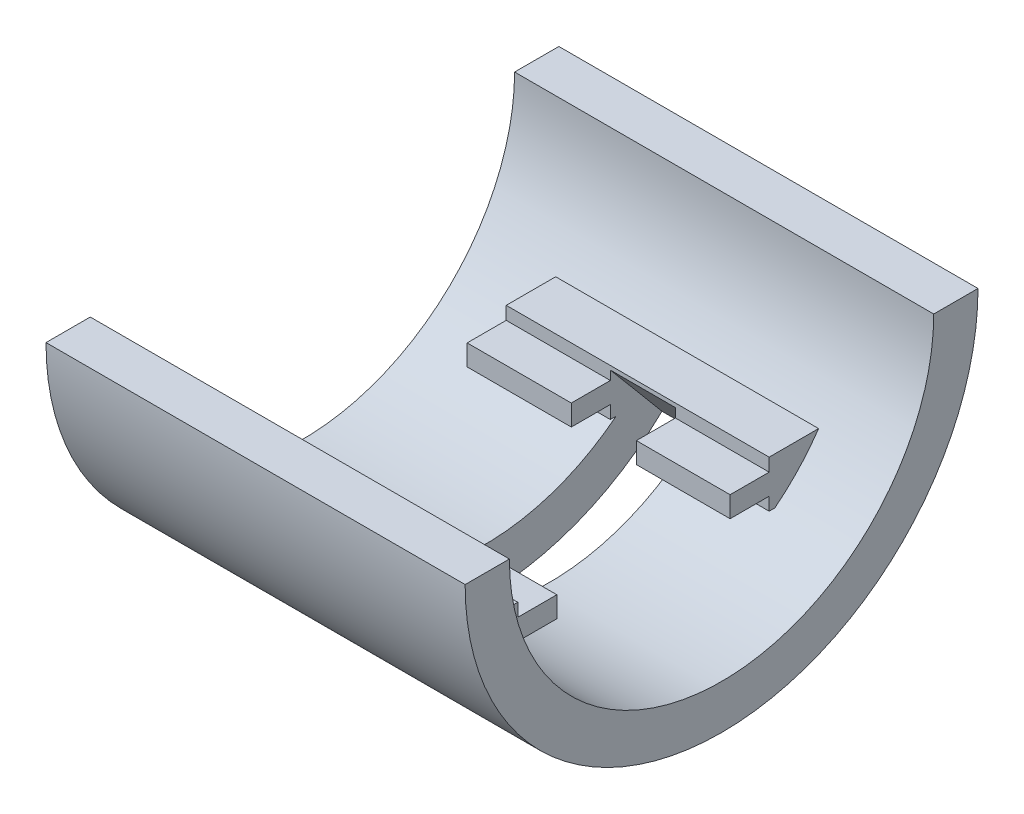
ISO-10303-21;
HEADER;
FILE_DESCRIPTION(('STEP AP214'),'2;1');
FILE_NAME('part.step','',(''),(''),'','','');
FILE_SCHEMA(('AUTOMOTIVE_DESIGN { 1 0 10303 214 1 1 1 1 }'));
ENDSEC;
DATA;
#1=APPLICATION_CONTEXT('core data for automotive mechanical design processes');
#2=APPLICATION_PROTOCOL_DEFINITION('international standard','automotive_design',2000,#1);
#3=PRODUCT_CONTEXT('',#1,'mechanical');
#4=PRODUCT('Part','Part','',(#3));
#5=PRODUCT_RELATED_PRODUCT_CATEGORY('part','',(#4));
#6=PRODUCT_DEFINITION_FORMATION('','',#4);
#7=PRODUCT_DEFINITION_CONTEXT('part definition',#1,'design');
#8=PRODUCT_DEFINITION('design','',#6,#7);
#9=PRODUCT_DEFINITION_SHAPE('','',#8);
#10=(LENGTH_UNIT() NAMED_UNIT(*) SI_UNIT(.MILLI.,.METRE.));
#11=(NAMED_UNIT(*) PLANE_ANGLE_UNIT() SI_UNIT($,.RADIAN.));
#12=(NAMED_UNIT(*) SI_UNIT($,.STERADIAN.) SOLID_ANGLE_UNIT());
#13=UNCERTAINTY_MEASURE_WITH_UNIT(LENGTH_MEASURE(1.E-05),#10,'distance_accuracy_value','');
#14=(GEOMETRIC_REPRESENTATION_CONTEXT(3) GLOBAL_UNCERTAINTY_ASSIGNED_CONTEXT((#13)) GLOBAL_UNIT_ASSIGNED_CONTEXT((#10,
#11,#12)) REPRESENTATION_CONTEXT('',''));
#15=CARTESIAN_POINT('',(0.,0.,0.));
#16=DIRECTION('',(0.,0.,1.));
#17=DIRECTION('',(1.,0.,0.));
#18=AXIS2_PLACEMENT_3D('',#15,#16,#17);
#19=CARTESIAN_POINT('',(0.,0.,0.));
#20=DIRECTION('',(0.,-1.,0.));
#21=DIRECTION('',(0.,0.,-1.));
#22=AXIS2_PLACEMENT_3D('',#19,#20,#21);
#23=PLANE('',#22);
#24=DIRECTION('',(-1.,0.,0.));
#25=VECTOR('',#24,1.);
#26=CARTESIAN_POINT('',(4.826,-1.74706743233033E-13,25.019));
#27=LINE('',#26,#25);
#28=CARTESIAN_POINT('',(0.,-1.74706743233033E-13,25.019));
#29=VERTEX_POINT('',#28);
#30=CARTESIAN_POINT('',(-40.894,-1.74706743233033E-13,25.019));
#31=VERTEX_POINT('',#30);
#32=EDGE_CURVE('E277',#29,#31,#27,.T.);
#33=ORIENTED_EDGE('',*,*,#32,.F.);
#34=DIRECTION('',(0.,0.,-1.));
#35=VECTOR('',#34,1.);
#36=CARTESIAN_POINT('',(0.,0.,0.));
#37=LINE('',#36,#35);
#38=CARTESIAN_POINT('',(0.,0.,20.701));
#39=VERTEX_POINT('',#38);
#40=EDGE_CURVE('E284',#29,#39,#37,.T.);
#41=ORIENTED_EDGE('',*,*,#40,.T.);
#42=DIRECTION('',(1.,0.,0.));
#43=VECTOR('',#42,1.);
#44=CARTESIAN_POINT('',(0.,-1.44554310390783E-13,20.701));
#45=LINE('',#44,#43);
#46=CARTESIAN_POINT('',(-40.894,-1.44554310390783E-13,20.701));
#47=VERTEX_POINT('',#46);
#48=EDGE_CURVE('E283',#47,#39,#45,.T.);
#49=ORIENTED_EDGE('',*,*,#48,.F.);
#50=DIRECTION('',(0.,0.,1.));
#51=VECTOR('',#50,1.);
#52=CARTESIAN_POINT('',(-40.894,0.,0.));
#53=LINE('',#52,#51);
#54=EDGE_CURVE('E272',#47,#31,#53,.T.);
#55=ORIENTED_EDGE('',*,*,#54,.T.);
#56=EDGE_LOOP('',(#33,#41,#49,#55));
#57=FACE_BOUND('',#56,.T.);
#58=ADVANCED_FACE('F37',(#57),#23,.F.);
#59=CARTESIAN_POINT('',(0.,0.,0.));
#60=DIRECTION('',(1.,0.,0.));
#61=DIRECTION('',(0.,0.,1.));
#62=AXIS2_PLACEMENT_3D('',#59,#60,#61);
#63=PLANE('',#62);
#64=CARTESIAN_POINT('',(0.,1.44554310390783E-13,-20.701));
#65=VERTEX_POINT('',#64);
#66=CARTESIAN_POINT('',(0.,1.74706743233033E-13,-25.019));
#67=VERTEX_POINT('',#66);
#68=EDGE_CURVE('E504',#65,#67,#37,.T.);
#69=ORIENTED_EDGE('',*,*,#68,.F.);
#70=CARTESIAN_POINT('',(0.,0.,0.));
#71=DIRECTION('',(-1.,0.,0.));
#72=DIRECTION('',(0.,0.,1.));
#73=AXIS2_PLACEMENT_3D('',#70,#71,#72);
#74=CIRCLE('',#73,20.701);
#75=EDGE_CURVE('E500',#65,#39,#74,.T.);
#76=ORIENTED_EDGE('',*,*,#75,.T.);
#77=ORIENTED_EDGE('',*,*,#40,.F.);
#78=CARTESIAN_POINT('',(0.,0.,0.));
#79=DIRECTION('',(-1.,0.,0.));
#80=DIRECTION('',(0.,0.,1.));
#81=AXIS2_PLACEMENT_3D('',#78,#79,#80);
#82=CIRCLE('',#81,25.019);
#83=EDGE_CURVE('E287',#67,#29,#82,.T.);
#84=ORIENTED_EDGE('',*,*,#83,.F.);
#85=EDGE_LOOP('',(#69,#76,#77,#84));
#86=FACE_BOUND('',#85,.T.);
#87=ADVANCED_FACE('F660',(#86),#63,.T.);
#88=CARTESIAN_POINT('',(-40.894,0.,0.));
#89=DIRECTION('',(-1.,0.,0.));
#90=DIRECTION('',(0.,0.,-1.));
#91=AXIS2_PLACEMENT_3D('',#88,#89,#90);
#92=PLANE('',#91);
#93=ORIENTED_EDGE('',*,*,#54,.F.);
#94=CARTESIAN_POINT('',(-40.894,0.,0.));
#95=DIRECTION('',(1.,0.,0.));
#96=DIRECTION('',(0.,0.,-1.));
#97=AXIS2_PLACEMENT_3D('',#94,#95,#96);
#98=CIRCLE('',#97,20.701);
#99=CARTESIAN_POINT('',(-40.894,1.44554310390783E-13,-20.701));
#100=VERTEX_POINT('',#99);
#101=EDGE_CURVE('E502',#47,#100,#98,.T.);
#102=ORIENTED_EDGE('',*,*,#101,.T.);
#103=CARTESIAN_POINT('',(-40.894,1.74706743233033E-13,-25.019));
#104=VERTEX_POINT('',#103);
#105=EDGE_CURVE('E275',#104,#100,#53,.T.);
#106=ORIENTED_EDGE('',*,*,#105,.F.);
#107=CARTESIAN_POINT('',(-40.894,0.,0.));
#108=DIRECTION('',(1.,0.,0.));
#109=DIRECTION('',(0.,0.,-1.));
#110=AXIS2_PLACEMENT_3D('',#107,#108,#109);
#111=CIRCLE('',#110,25.019);
#112=EDGE_CURVE('E269',#31,#104,#111,.T.);
#113=ORIENTED_EDGE('',*,*,#112,.F.);
#114=EDGE_LOOP('',(#93,#102,#106,#113));
#115=FACE_BOUND('',#114,.T.);
#116=ADVANCED_FACE('F39',(#115),#92,.T.);
#117=DIRECTION('',(-1.,0.,0.));
#118=VECTOR('',#117,1.);
#119=CARTESIAN_POINT('',(4.826,1.74706743233033E-13,-25.019));
#120=LINE('',#119,#118);
#121=EDGE_CURVE('E52',#67,#104,#120,.T.);
#122=ORIENTED_EDGE('',*,*,#121,.T.);
#123=ORIENTED_EDGE('',*,*,#105,.T.);
#124=DIRECTION('',(1.,0.,0.));
#125=VECTOR('',#124,1.);
#126=CARTESIAN_POINT('',(0.,1.44554310390783E-13,-20.701));
#127=LINE('',#126,#125);
#128=EDGE_CURVE('E506',#65,#100,#127,.F.);
#129=ORIENTED_EDGE('',*,*,#128,.F.);
#130=ORIENTED_EDGE('',*,*,#68,.T.);
#131=EDGE_LOOP('',(#122,#123,#129,#130));
#132=FACE_BOUND('',#131,.T.);
#133=ADVANCED_FACE('F662',(#132),#23,.F.);
#134=CARTESIAN_POINT('',(0.,0.594247114477798,-1.63268052860381));
#135=DIRECTION('',(0.,-0.642787609686541,0.766044443118977));
#136=DIRECTION('',(-1.,0.,0.));
#137=AXIS2_PLACEMENT_3D('',#134,#135,#136);
#138=PLANE('',#137);
#139=DIRECTION('',(0.,-0.766044443118977,-0.642787609686541));
#140=VECTOR('',#139,1.);
#141=CARTESIAN_POINT('',(-16.764,-21.1045473889342,-19.8401309934085));
#142=LINE('',#141,#140);
#143=CARTESIAN_POINT('',(-16.764,-12.073833542669,-12.2624623357398));
#144=VERTEX_POINT('',#143);
#145=CARTESIAN_POINT('',(-16.764,-18.0753465215828,-17.298329662852));
#146=VERTEX_POINT('',#145);
#147=EDGE_CURVE('E303',#144,#146,#142,.T.);
#148=ORIENTED_EDGE('',*,*,#147,.F.);
#149=DIRECTION('',(1.,0.,0.));
#150=VECTOR('',#149,1.);
#151=CARTESIAN_POINT('',(-33.274,-12.073833542669,-12.2624623357398));
#152=LINE('',#151,#150);
#153=CARTESIAN_POINT('',(-23.114,-12.073833542669,-12.2624623357398));
#154=VERTEX_POINT('',#153);
#155=EDGE_CURVE('E382',#154,#144,#152,.T.);
#156=ORIENTED_EDGE('',*,*,#155,.F.);
#157=DIRECTION('',(0.,0.766044443118977,0.642787609686541));
#158=VECTOR('',#157,1.);
#159=CARTESIAN_POINT('',(-23.114,-21.1045473889342,-19.8401309934085));
#160=LINE('',#159,#158);
#161=CARTESIAN_POINT('',(-23.114,-18.0753465215828,-17.298329662852));
#162=VERTEX_POINT('',#161);
#163=EDGE_CURVE('E300',#162,#154,#160,.T.);
#164=ORIENTED_EDGE('',*,*,#163,.F.);
#165=DIRECTION('',(-1.,0.,0.));
#166=VECTOR('',#165,1.);
#167=CARTESIAN_POINT('',(4.826,-18.0753465215828,-17.298329662852));
#168=LINE('',#167,#166);
#169=EDGE_CURVE('E295',#146,#162,#168,.T.);
#170=ORIENTED_EDGE('',*,*,#169,.F.);
#171=EDGE_LOOP('',(#148,#156,#164,#170));
#172=FACE_BOUND('',#171,.T.);
#173=ADVANCED_FACE('F532',(#172),#138,.T.);
#174=CARTESIAN_POINT('',(0.,0.594247114477798,1.63268052860381));
#175=DIRECTION('',(0.,0.642787609686541,0.766044443118977));
#176=DIRECTION('',(-1.,0.,0.));
#177=AXIS2_PLACEMENT_3D('',#174,#175,#176);
#178=PLANE('',#177);
#179=DIRECTION('',(-1.,0.,0.));
#180=VECTOR('',#179,1.);
#181=CARTESIAN_POINT('',(4.826,-18.0753465215828,17.298329662852));
#182=LINE('',#181,#180);
#183=CARTESIAN_POINT('',(-16.764,-18.0753465215828,17.298329662852));
#184=VERTEX_POINT('',#183);
#185=CARTESIAN_POINT('',(-23.114,-18.0753465215828,17.298329662852));
#186=VERTEX_POINT('',#185);
#187=EDGE_CURVE('E290',#184,#186,#182,.T.);
#188=ORIENTED_EDGE('',*,*,#187,.T.);
#189=DIRECTION('',(0.,0.766044443118977,-0.642787609686541));
#190=VECTOR('',#189,1.);
#191=CARTESIAN_POINT('',(-23.114,-21.1045473889342,19.8401309934085));
#192=LINE('',#191,#190);
#193=CARTESIAN_POINT('',(-23.114,-12.073833542669,12.2624623357398));
#194=VERTEX_POINT('',#193);
#195=EDGE_CURVE('E306',#186,#194,#192,.T.);
#196=ORIENTED_EDGE('',*,*,#195,.T.);
#197=DIRECTION('',(1.,0.,0.));
#198=VECTOR('',#197,1.);
#199=CARTESIAN_POINT('',(-33.274,-12.073833542669,12.2624623357398));
#200=LINE('',#199,#198);
#201=CARTESIAN_POINT('',(-16.764,-12.073833542669,12.2624623357398));
#202=VERTEX_POINT('',#201);
#203=EDGE_CURVE('E45',#194,#202,#200,.T.);
#204=ORIENTED_EDGE('',*,*,#203,.T.);
#205=DIRECTION('',(0.,-0.766044443118977,0.642787609686541));
#206=VECTOR('',#205,1.);
#207=CARTESIAN_POINT('',(-16.764,-21.1045473889342,19.8401309934085));
#208=LINE('',#207,#206);
#209=EDGE_CURVE('E309',#202,#184,#208,.T.);
#210=ORIENTED_EDGE('',*,*,#209,.T.);
#211=EDGE_LOOP('',(#188,#196,#204,#210));
#212=FACE_BOUND('',#211,.T.);
#213=ADVANCED_FACE('F517',(#212),#178,.F.);
#214=CARTESIAN_POINT('',(-23.114,-21.1045473889342,19.8401309934085));
#215=DIRECTION('',(1.,0.,0.));
#216=DIRECTION('',(0.,0.,1.));
#217=AXIS2_PLACEMENT_3D('',#214,#215,#216);
#218=PLANE('',#217);
#219=ORIENTED_EDGE('',*,*,#163,.T.);
#220=DIRECTION('',(0.,1.,0.));
#221=VECTOR('',#220,1.);
#222=CARTESIAN_POINT('',(-23.114,-16.2560000000001,-12.2624623357398));
#223=LINE('',#222,#221);
#224=CARTESIAN_POINT('',(-23.114,-12.9540000000001,-12.2624623357398));
#225=VERTEX_POINT('',#224);
#226=EDGE_CURVE('E380',#225,#154,#223,.T.);
#227=ORIENTED_EDGE('',*,*,#226,.F.);
#228=DIRECTION('',(0.,0.,1.));
#229=VECTOR('',#228,1.);
#230=CARTESIAN_POINT('',(-23.114,-12.9540000000001,-12.2624623357398));
#231=LINE('',#230,#229);
#232=CARTESIAN_POINT('',(-23.114,-12.9540000000001,-8.45246233573977));
#233=VERTEX_POINT('',#232);
#234=EDGE_CURVE('E377',#225,#233,#231,.T.);
#235=ORIENTED_EDGE('',*,*,#234,.T.);
#236=DIRECTION('',(0.,-1.,0.));
#237=VECTOR('',#236,1.);
#238=CARTESIAN_POINT('',(-23.114,-12.9540000000001,-8.45246233573977));
#239=LINE('',#238,#237);
#240=CARTESIAN_POINT('',(-23.114,-14.9860000000001,-8.45246233573976));
#241=VERTEX_POINT('',#240);
#242=EDGE_CURVE('E374',#233,#241,#239,.T.);
#243=ORIENTED_EDGE('',*,*,#242,.T.);
#244=DIRECTION('',(0.,0.,-1.));
#245=VECTOR('',#244,1.);
#246=CARTESIAN_POINT('',(-23.114,-14.9860000000001,-12.2624623357398));
#247=LINE('',#246,#245);
#248=CARTESIAN_POINT('',(-23.114,-14.9860000000001,-12.2624623357398));
#249=VERTEX_POINT('',#248);
#250=EDGE_CURVE('E371',#241,#249,#247,.T.);
#251=ORIENTED_EDGE('',*,*,#250,.T.);
#252=DIRECTION('',(0.,1.,0.));
#253=VECTOR('',#252,1.);
#254=CARTESIAN_POINT('',(-23.114,-16.2560000000001,-12.2624623357398));
#255=LINE('',#254,#253);
#256=CARTESIAN_POINT('',(-23.114,-16.2560000000001,-12.2624623357397));
#257=VERTEX_POINT('',#256);
#258=EDGE_CURVE('E368',#257,#249,#255,.T.);
#259=ORIENTED_EDGE('',*,*,#258,.F.);
#260=DIRECTION('',(0.,0.,1.));
#261=VECTOR('',#260,1.);
#262=CARTESIAN_POINT('',(-23.114,-16.2560000000001,25.401));
#263=LINE('',#262,#261);
#264=CARTESIAN_POINT('',(-23.114,-16.2560000000001,-12.8169366464844));
#265=VERTEX_POINT('',#264);
#266=EDGE_CURVE('E365',#265,#257,#263,.T.);
#267=ORIENTED_EDGE('',*,*,#266,.F.);
#268=CARTESIAN_POINT('',(-23.114,0.,0.));
#269=DIRECTION('',(-1.,0.,0.));
#270=DIRECTION('',(0.,0.,1.));
#271=AXIS2_PLACEMENT_3D('',#268,#269,#270);
#272=CIRCLE('',#271,20.701);
#273=CARTESIAN_POINT('',(-23.114,-16.2560000000001,12.8169366464844));
#274=VERTEX_POINT('',#273);
#275=EDGE_CURVE('E362',#274,#265,#272,.F.);
#276=ORIENTED_EDGE('',*,*,#275,.F.);
#277=DIRECTION('',(0.,0.,1.));
#278=VECTOR('',#277,1.);
#279=CARTESIAN_POINT('',(-23.114,-16.2560000000001,25.401));
#280=LINE('',#279,#278);
#281=CARTESIAN_POINT('',(-23.114,-16.2560000000001,12.2624623357398));
#282=VERTEX_POINT('',#281);
#283=EDGE_CURVE('E359',#282,#274,#280,.T.);
#284=ORIENTED_EDGE('',*,*,#283,.F.);
#285=DIRECTION('',(0.,-1.,0.));
#286=VECTOR('',#285,1.);
#287=CARTESIAN_POINT('',(-23.114,-16.2560000000001,12.2624623357398));
#288=LINE('',#287,#286);
#289=CARTESIAN_POINT('',(-23.114,-14.9860000000001,12.2624623357398));
#290=VERTEX_POINT('',#289);
#291=EDGE_CURVE('E356',#290,#282,#288,.T.);
#292=ORIENTED_EDGE('',*,*,#291,.F.);
#293=DIRECTION('',(0.,0.,-1.));
#294=VECTOR('',#293,1.);
#295=CARTESIAN_POINT('',(-23.114,-14.9860000000001,12.2624623357398));
#296=LINE('',#295,#294);
#297=CARTESIAN_POINT('',(-23.114,-14.9860000000001,8.45246233573977));
#298=VERTEX_POINT('',#297);
#299=EDGE_CURVE('E350',#290,#298,#296,.T.);
#300=ORIENTED_EDGE('',*,*,#299,.T.);
#301=DIRECTION('',(0.,1.,0.));
#302=VECTOR('',#301,1.);
#303=CARTESIAN_POINT('',(-23.114,-12.9540000000001,8.45246233573977));
#304=LINE('',#303,#302);
#305=CARTESIAN_POINT('',(-23.114,-12.9540000000001,8.45246233573977));
#306=VERTEX_POINT('',#305);
#307=EDGE_CURVE('E347',#298,#306,#304,.T.);
#308=ORIENTED_EDGE('',*,*,#307,.T.);
#309=DIRECTION('',(0.,0.,1.));
#310=VECTOR('',#309,1.);
#311=CARTESIAN_POINT('',(-23.114,-12.9540000000001,12.2624623357398));
#312=LINE('',#311,#310);
#313=CARTESIAN_POINT('',(-23.114,-12.9540000000001,12.2624623357398));
#314=VERTEX_POINT('',#313);
#315=EDGE_CURVE('E512',#306,#314,#312,.T.);
#316=ORIENTED_EDGE('',*,*,#315,.T.);
#317=DIRECTION('',(0.,-1.,0.));
#318=VECTOR('',#317,1.);
#319=CARTESIAN_POINT('',(-23.114,-16.2560000000001,12.2624623357398));
#320=LINE('',#319,#318);
#321=EDGE_CURVE('E353',#194,#314,#320,.T.);
#322=ORIENTED_EDGE('',*,*,#321,.F.);
#323=ORIENTED_EDGE('',*,*,#195,.F.);
#324=CARTESIAN_POINT('',(-23.114,0.,0.));
#325=DIRECTION('',(-1.,0.,0.));
#326=DIRECTION('',(0.,0.,1.));
#327=AXIS2_PLACEMENT_3D('',#324,#325,#326);
#328=CIRCLE('',#327,25.019);
#329=EDGE_CURVE('E297',#162,#186,#328,.T.);
#330=ORIENTED_EDGE('',*,*,#329,.F.);
#331=EDGE_LOOP('',(#219,#227,#235,#243,#251,#259,#267,#276,#284,#292,#300,#308,#316,#322,#323,#330));
#332=FACE_BOUND('',#331,.T.);
#333=ADVANCED_FACE('F535',(#332),#218,.T.);
#334=CARTESIAN_POINT('',(-16.764,-21.1045473889342,19.8401309934085));
#335=DIRECTION('',(-1.,0.,0.));
#336=DIRECTION('',(0.,0.,-1.));
#337=AXIS2_PLACEMENT_3D('',#334,#335,#336);
#338=PLANE('',#337);
#339=ORIENTED_EDGE('',*,*,#209,.F.);
#340=DIRECTION('',(0.,1.,0.));
#341=VECTOR('',#340,1.);
#342=CARTESIAN_POINT('',(-16.764,-16.2560000000001,12.2624623357398));
#343=LINE('',#342,#341);
#344=CARTESIAN_POINT('',(-16.764,-12.9540000000001,12.2624623357398));
#345=VERTEX_POINT('',#344);
#346=EDGE_CURVE('E318',#345,#202,#343,.T.);
#347=ORIENTED_EDGE('',*,*,#346,.F.);
#348=DIRECTION('',(0.,0.,-1.));
#349=VECTOR('',#348,1.);
#350=CARTESIAN_POINT('',(-16.764,-12.9540000000001,12.2624623357398));
#351=LINE('',#350,#349);
#352=CARTESIAN_POINT('',(-16.764,-12.9540000000001,8.45246233573977));
#353=VERTEX_POINT('',#352);
#354=EDGE_CURVE('E509',#345,#353,#351,.T.);
#355=ORIENTED_EDGE('',*,*,#354,.T.);
#356=DIRECTION('',(0.,-1.,0.));
#357=VECTOR('',#356,1.);
#358=CARTESIAN_POINT('',(-16.764,-12.9540000000001,8.45246233573977));
#359=LINE('',#358,#357);
#360=CARTESIAN_POINT('',(-16.764,-14.9860000000001,8.45246233573977));
#361=VERTEX_POINT('',#360);
#362=EDGE_CURVE('E312',#353,#361,#359,.T.);
#363=ORIENTED_EDGE('',*,*,#362,.T.);
#364=DIRECTION('',(0.,0.,1.));
#365=VECTOR('',#364,1.);
#366=CARTESIAN_POINT('',(-16.764,-14.9860000000001,12.2624623357398));
#367=LINE('',#366,#365);
#368=CARTESIAN_POINT('',(-16.764,-14.9860000000001,12.2624623357398));
#369=VERTEX_POINT('',#368);
#370=EDGE_CURVE('E315',#361,#369,#367,.T.);
#371=ORIENTED_EDGE('',*,*,#370,.T.);
#372=DIRECTION('',(0.,1.,0.));
#373=VECTOR('',#372,1.);
#374=CARTESIAN_POINT('',(-16.764,-16.2560000000001,12.2624623357398));
#375=LINE('',#374,#373);
#376=CARTESIAN_POINT('',(-16.764,-16.2560000000001,12.2624623357398));
#377=VERTEX_POINT('',#376);
#378=EDGE_CURVE('E320',#377,#369,#375,.T.);
#379=ORIENTED_EDGE('',*,*,#378,.F.);
#380=DIRECTION('',(0.,0.,-1.));
#381=VECTOR('',#380,1.);
#382=CARTESIAN_POINT('',(-16.764,-16.2560000000001,25.401));
#383=LINE('',#382,#381);
#384=CARTESIAN_POINT('',(-16.764,-16.2560000000001,12.8169366464844));
#385=VERTEX_POINT('',#384);
#386=EDGE_CURVE('E323',#385,#377,#383,.T.);
#387=ORIENTED_EDGE('',*,*,#386,.F.);
#388=CARTESIAN_POINT('',(-16.764,0.,0.));
#389=DIRECTION('',(1.,0.,0.));
#390=DIRECTION('',(0.,0.,-1.));
#391=AXIS2_PLACEMENT_3D('',#388,#389,#390);
#392=CIRCLE('',#391,20.701);
#393=CARTESIAN_POINT('',(-16.764,-16.2560000000001,-12.8169366464844));
#394=VERTEX_POINT('',#393);
#395=EDGE_CURVE('E326',#394,#385,#392,.F.);
#396=ORIENTED_EDGE('',*,*,#395,.F.);
#397=DIRECTION('',(0.,0.,-1.));
#398=VECTOR('',#397,1.);
#399=CARTESIAN_POINT('',(-16.764,-16.2560000000001,25.401));
#400=LINE('',#399,#398);
#401=CARTESIAN_POINT('',(-16.764,-16.2560000000001,-12.2624623357397));
#402=VERTEX_POINT('',#401);
#403=EDGE_CURVE('E329',#402,#394,#400,.T.);
#404=ORIENTED_EDGE('',*,*,#403,.F.);
#405=DIRECTION('',(0.,-1.,0.));
#406=VECTOR('',#405,1.);
#407=CARTESIAN_POINT('',(-16.764,-16.2560000000001,-12.2624623357398));
#408=LINE('',#407,#406);
#409=CARTESIAN_POINT('',(-16.764,-14.9860000000001,-12.2624623357398));
#410=VERTEX_POINT('',#409);
#411=EDGE_CURVE('E332',#410,#402,#408,.T.);
#412=ORIENTED_EDGE('',*,*,#411,.F.);
#413=DIRECTION('',(0.,0.,1.));
#414=VECTOR('',#413,1.);
#415=CARTESIAN_POINT('',(-16.764,-14.9860000000001,-12.2624623357398));
#416=LINE('',#415,#414);
#417=CARTESIAN_POINT('',(-16.764,-14.9860000000001,-8.45246233573976));
#418=VERTEX_POINT('',#417);
#419=EDGE_CURVE('E335',#410,#418,#416,.T.);
#420=ORIENTED_EDGE('',*,*,#419,.T.);
#421=DIRECTION('',(0.,1.,0.));
#422=VECTOR('',#421,1.);
#423=CARTESIAN_POINT('',(-16.764,-12.9540000000001,-8.45246233573977));
#424=LINE('',#423,#422);
#425=CARTESIAN_POINT('',(-16.764,-12.9540000000001,-8.45246233573977));
#426=VERTEX_POINT('',#425);
#427=EDGE_CURVE('E338',#418,#426,#424,.T.);
#428=ORIENTED_EDGE('',*,*,#427,.T.);
#429=DIRECTION('',(0.,0.,-1.));
#430=VECTOR('',#429,1.);
#431=CARTESIAN_POINT('',(-16.764,-12.9540000000001,-12.2624623357398));
#432=LINE('',#431,#430);
#433=CARTESIAN_POINT('',(-16.764,-12.9540000000001,-12.2624623357398));
#434=VERTEX_POINT('',#433);
#435=EDGE_CURVE('E341',#426,#434,#432,.T.);
#436=ORIENTED_EDGE('',*,*,#435,.T.);
#437=DIRECTION('',(0.,-1.,0.));
#438=VECTOR('',#437,1.);
#439=CARTESIAN_POINT('',(-16.764,-16.2560000000001,-12.2624623357398));
#440=LINE('',#439,#438);
#441=EDGE_CURVE('E344',#144,#434,#440,.T.);
#442=ORIENTED_EDGE('',*,*,#441,.F.);
#443=ORIENTED_EDGE('',*,*,#147,.T.);
#444=CARTESIAN_POINT('',(-16.764,0.,0.));
#445=DIRECTION('',(1.,0.,0.));
#446=DIRECTION('',(0.,0.,-1.));
#447=AXIS2_PLACEMENT_3D('',#444,#445,#446);
#448=CIRCLE('',#447,25.019);
#449=EDGE_CURVE('E11',#184,#146,#448,.T.);
#450=ORIENTED_EDGE('',*,*,#449,.F.);
#451=EDGE_LOOP('',(#339,#347,#355,#363,#371,#379,#387,#396,#404,#412,#420,#428,#436,#442,#443,#450));
#452=FACE_BOUND('',#451,.T.);
#453=ADVANCED_FACE('F528',(#452),#338,.T.);
#454=CARTESIAN_POINT('',(-33.274,-16.2560000000001,12.2624623357398));
#455=DIRECTION('',(0.,0.,1.));
#456=DIRECTION('',(-1.,0.,0.));
#457=AXIS2_PLACEMENT_3D('',#454,#455,#456);
#458=PLANE('',#457);
#459=ORIENTED_EDGE('',*,*,#291,.T.);
#460=DIRECTION('',(-1.,0.,0.));
#461=VECTOR('',#460,1.);
#462=CARTESIAN_POINT('',(-33.274,-16.2560000000001,12.2624623357398));
#463=LINE('',#462,#461);
#464=CARTESIAN_POINT('',(-33.274,-16.2560000000001,12.2624623357398));
#465=VERTEX_POINT('',#464);
#466=EDGE_CURVE('E440',#282,#465,#463,.T.);
#467=ORIENTED_EDGE('',*,*,#466,.T.);
#468=DIRECTION('',(0.,1.,0.));
#469=VECTOR('',#468,1.);
#470=CARTESIAN_POINT('',(-33.274,-16.2560000000001,12.2624623357398));
#471=LINE('',#470,#469);
#472=CARTESIAN_POINT('',(-33.274,-14.9860000000001,12.2624623357398));
#473=VERTEX_POINT('',#472);
#474=EDGE_CURVE('E450',#465,#473,#471,.T.);
#475=ORIENTED_EDGE('',*,*,#474,.T.);
#476=DIRECTION('',(1.,0.,0.));
#477=VECTOR('',#476,1.);
#478=CARTESIAN_POINT('',(-37.592,-14.9860000000001,12.2624623357398));
#479=LINE('',#478,#477);
#480=EDGE_CURVE('E390',#473,#290,#479,.T.);
#481=ORIENTED_EDGE('',*,*,#480,.T.);
#482=EDGE_LOOP('',(#459,#467,#475,#481));
#483=FACE_BOUND('',#482,.T.);
#484=ADVANCED_FACE('F643',(#483),#458,.F.);
#485=ORIENTED_EDGE('',*,*,#378,.T.);
#486=CARTESIAN_POINT('',(-7.62,-14.9860000000001,12.2624623357398));
#487=VERTEX_POINT('',#486);
#488=EDGE_CURVE('E401',#369,#487,#479,.T.);
#489=ORIENTED_EDGE('',*,*,#488,.T.);
#490=DIRECTION('',(0.,1.,0.));
#491=VECTOR('',#490,1.);
#492=CARTESIAN_POINT('',(-7.62,-16.2560000000001,12.2624623357398));
#493=LINE('',#492,#491);
#494=CARTESIAN_POINT('',(-7.62,-16.2560000000001,12.2624623357398));
#495=VERTEX_POINT('',#494);
#496=EDGE_CURVE('E455',#495,#487,#493,.T.);
#497=ORIENTED_EDGE('',*,*,#496,.F.);
#498=EDGE_CURVE('E442',#495,#377,#463,.T.);
#499=ORIENTED_EDGE('',*,*,#498,.T.);
#500=EDGE_LOOP('',(#485,#489,#497,#499));
#501=FACE_BOUND('',#500,.T.);
#502=ADVANCED_FACE('F570',(#501),#458,.F.);
#503=CARTESIAN_POINT('',(-33.274,-16.2560000000001,-12.2624623357398));
#504=DIRECTION('',(0.,0.,-1.));
#505=DIRECTION('',(1.,0.,0.));
#506=AXIS2_PLACEMENT_3D('',#503,#504,#505);
#507=PLANE('',#506);
#508=ORIENTED_EDGE('',*,*,#226,.T.);
#509=ORIENTED_EDGE('',*,*,#155,.T.);
#510=ORIENTED_EDGE('',*,*,#441,.T.);
#511=DIRECTION('',(1.,0.,0.));
#512=VECTOR('',#511,1.);
#513=CARTESIAN_POINT('',(-37.592,-12.9540000000001,-12.2624623357398));
#514=LINE('',#513,#512);
#515=CARTESIAN_POINT('',(-7.62,-12.9540000000001,-12.2624623357398));
#516=VERTEX_POINT('',#515);
#517=EDGE_CURVE('E427',#434,#516,#514,.T.);
#518=ORIENTED_EDGE('',*,*,#517,.T.);
#519=DIRECTION('',(0.,1.,0.));
#520=VECTOR('',#519,1.);
#521=CARTESIAN_POINT('',(-7.62,-16.2560000000001,-12.2624623357398));
#522=LINE('',#521,#520);
#523=CARTESIAN_POINT('',(-7.62,-11.6840000000001,-12.2624623357398));
#524=VERTEX_POINT('',#523);
#525=EDGE_CURVE('E462',#516,#524,#522,.T.);
#526=ORIENTED_EDGE('',*,*,#525,.T.);
#527=DIRECTION('',(1.,0.,0.));
#528=VECTOR('',#527,1.);
#529=CARTESIAN_POINT('',(-33.274,-11.6840000000001,-12.2624623357398));
#530=LINE('',#529,#528);
#531=CARTESIAN_POINT('',(-33.274,-11.6840000000001,-12.2624623357398));
#532=VERTEX_POINT('',#531);
#533=EDGE_CURVE('E437',#532,#524,#530,.T.);
#534=ORIENTED_EDGE('',*,*,#533,.F.);
#535=DIRECTION('',(0.,1.,0.));
#536=VECTOR('',#535,1.);
#537=CARTESIAN_POINT('',(-33.274,-16.2560000000001,-12.2624623357398));
#538=LINE('',#537,#536);
#539=CARTESIAN_POINT('',(-33.274,-12.9540000000001,-12.2624623357398));
#540=VERTEX_POINT('',#539);
#541=EDGE_CURVE('E444',#540,#532,#538,.T.);
#542=ORIENTED_EDGE('',*,*,#541,.F.);
#543=EDGE_CURVE('E416',#540,#225,#514,.T.);
#544=ORIENTED_EDGE('',*,*,#543,.T.);
#545=EDGE_LOOP('',(#508,#509,#510,#518,#526,#534,#542,#544));
#546=FACE_BOUND('',#545,.T.);
#547=ADVANCED_FACE('F608',(#546),#507,.F.);
#548=CARTESIAN_POINT('',(-33.274,-16.2560000000001,25.401));
#549=DIRECTION('',(0.,1.,0.));
#550=DIRECTION('',(1.,0.,0.));
#551=AXIS2_PLACEMENT_3D('',#548,#549,#550);
#552=PLANE('',#551);
#553=ORIENTED_EDGE('',*,*,#283,.T.);
#554=DIRECTION('',(1.,0.,0.));
#555=VECTOR('',#554,1.);
#556=CARTESIAN_POINT('',(0.,-16.2560000000001,12.8169366464844));
#557=LINE('',#556,#555);
#558=CARTESIAN_POINT('',(-33.274,-16.2560000000001,12.8169366464844));
#559=VERTEX_POINT('',#558);
#560=EDGE_CURVE('E487',#274,#559,#557,.F.);
#561=ORIENTED_EDGE('',*,*,#560,.T.);
#562=DIRECTION('',(0.,0.,-1.));
#563=VECTOR('',#562,1.);
#564=CARTESIAN_POINT('',(-33.274,-16.2560000000001,25.401));
#565=LINE('',#564,#563);
#566=EDGE_CURVE('E488',#559,#465,#565,.T.);
#567=ORIENTED_EDGE('',*,*,#566,.T.);
#568=ORIENTED_EDGE('',*,*,#466,.F.);
#569=EDGE_LOOP('',(#553,#561,#567,#568));
#570=FACE_BOUND('',#569,.T.);
#571=ADVANCED_FACE('F639',(#570),#552,.F.);
#572=ORIENTED_EDGE('',*,*,#386,.T.);
#573=ORIENTED_EDGE('',*,*,#498,.F.);
#574=DIRECTION('',(0.,0.,-1.));
#575=VECTOR('',#574,1.);
#576=CARTESIAN_POINT('',(-7.62,-16.2560000000001,25.401));
#577=LINE('',#576,#575);
#578=CARTESIAN_POINT('',(-7.62,-16.2560000000001,12.8169366464844));
#579=VERTEX_POINT('',#578);
#580=EDGE_CURVE('E491',#579,#495,#577,.T.);
#581=ORIENTED_EDGE('',*,*,#580,.F.);
#582=EDGE_CURVE('E498',#579,#385,#557,.F.);
#583=ORIENTED_EDGE('',*,*,#582,.T.);
#584=EDGE_LOOP('',(#572,#573,#581,#583));
#585=FACE_BOUND('',#584,.T.);
#586=ADVANCED_FACE('F576',(#585),#552,.F.);
#587=CARTESIAN_POINT('',(0.,0.,0.));
#588=DIRECTION('',(1.,0.,0.));
#589=DIRECTION('',(0.,0.,1.));
#590=AXIS2_PLACEMENT_3D('',#587,#588,#589);
#591=CYLINDRICAL_SURFACE('',#590,20.701);
#592=ORIENTED_EDGE('',*,*,#101,.F.);
#593=ORIENTED_EDGE('',*,*,#48,.T.);
#594=ORIENTED_EDGE('',*,*,#75,.F.);
#595=ORIENTED_EDGE('',*,*,#128,.T.);
#596=EDGE_LOOP('',(#592,#593,#594,#595));
#597=FACE_BOUND('',#596,.T.);
#598=ORIENTED_EDGE('',*,*,#275,.T.);
#599=DIRECTION('',(1.,0.,0.));
#600=VECTOR('',#599,1.);
#601=CARTESIAN_POINT('',(0.,-16.2560000000001,-12.8169366464844));
#602=LINE('',#601,#600);
#603=CARTESIAN_POINT('',(-33.274,-16.2560000000001,-12.8169366464844));
#604=VERTEX_POINT('',#603);
#605=EDGE_CURVE('E469',#265,#604,#602,.F.);
#606=ORIENTED_EDGE('',*,*,#605,.T.);
#607=CARTESIAN_POINT('',(-33.274,0.,0.));
#608=DIRECTION('',(1.,0.,0.));
#609=DIRECTION('',(0.,0.,-1.));
#610=AXIS2_PLACEMENT_3D('',#607,#608,#609);
#611=CIRCLE('',#610,20.701);
#612=CARTESIAN_POINT('',(-33.274,-11.6840000000001,-17.0884623357398));
#613=VERTEX_POINT('',#612);
#614=EDGE_CURVE('E472',#604,#613,#611,.T.);
#615=ORIENTED_EDGE('',*,*,#614,.T.);
#616=DIRECTION('',(1.,0.,0.));
#617=VECTOR('',#616,1.);
#618=CARTESIAN_POINT('',(0.,-11.6840000000001,-17.0884623357398));
#619=LINE('',#618,#617);
#620=CARTESIAN_POINT('',(-7.62,-11.6840000000001,-17.0884623357398));
#621=VERTEX_POINT('',#620);
#622=EDGE_CURVE('E453',#613,#621,#619,.T.);
#623=ORIENTED_EDGE('',*,*,#622,.T.);
#624=CARTESIAN_POINT('',(-7.62,0.,0.));
#625=DIRECTION('',(-1.,0.,0.));
#626=DIRECTION('',(0.,-1.,0.));
#627=AXIS2_PLACEMENT_3D('',#624,#625,#626);
#628=CIRCLE('',#627,20.701);
#629=CARTESIAN_POINT('',(-7.62,-16.2560000000001,-12.8169366464844));
#630=VERTEX_POINT('',#629);
#631=EDGE_CURVE('E466',#621,#630,#628,.T.);
#632=ORIENTED_EDGE('',*,*,#631,.T.);
#633=EDGE_CURVE('E470',#630,#394,#602,.F.);
#634=ORIENTED_EDGE('',*,*,#633,.T.);
#635=ORIENTED_EDGE('',*,*,#395,.T.);
#636=ORIENTED_EDGE('',*,*,#582,.F.);
#637=CARTESIAN_POINT('',(-7.62,0.,0.));
#638=DIRECTION('',(1.,0.,0.));
#639=DIRECTION('',(0.,1.,0.));
#640=AXIS2_PLACEMENT_3D('',#637,#638,#639);
#641=CIRCLE('',#640,20.701);
#642=CARTESIAN_POINT('',(-7.62,-11.6840000000001,17.0884623357398));
#643=VERTEX_POINT('',#642);
#644=EDGE_CURVE('E478',#643,#579,#641,.T.);
#645=ORIENTED_EDGE('',*,*,#644,.F.);
#646=DIRECTION('',(1.,0.,0.));
#647=VECTOR('',#646,1.);
#648=CARTESIAN_POINT('',(0.,-11.6840000000001,17.0884623357398));
#649=LINE('',#648,#647);
#650=CARTESIAN_POINT('',(-33.274,-11.6840000000001,17.0884623357398));
#651=VERTEX_POINT('',#650);
#652=EDGE_CURVE('E480',#651,#643,#649,.T.);
#653=ORIENTED_EDGE('',*,*,#652,.F.);
#654=CARTESIAN_POINT('',(-33.274,0.,0.));
#655=DIRECTION('',(-1.,0.,0.));
#656=DIRECTION('',(0.,0.,1.));
#657=AXIS2_PLACEMENT_3D('',#654,#655,#656);
#658=CIRCLE('',#657,20.701);
#659=EDGE_CURVE('E484',#559,#651,#658,.T.);
#660=ORIENTED_EDGE('',*,*,#659,.F.);
#661=ORIENTED_EDGE('',*,*,#560,.F.);
#662=EDGE_LOOP('',(#598,#606,#615,#623,#632,#634,#635,#636,#645,#653,#660,#661));
#663=FACE_BOUND('',#662,.T.);
#664=ADVANCED_FACE('F580',(#597,#663),#591,.F.);
#665=ORIENTED_EDGE('',*,*,#266,.T.);
#666=DIRECTION('',(1.,0.,0.));
#667=VECTOR('',#666,1.);
#668=CARTESIAN_POINT('',(-33.274,-16.2560000000001,-12.2624623357398));
#669=LINE('',#668,#667);
#670=CARTESIAN_POINT('',(-33.274,-16.2560000000001,-12.2624623357398));
#671=VERTEX_POINT('',#670);
#672=EDGE_CURVE('E438',#671,#257,#669,.T.);
#673=ORIENTED_EDGE('',*,*,#672,.F.);
#674=EDGE_CURVE('E475',#671,#604,#565,.T.);
#675=ORIENTED_EDGE('',*,*,#674,.T.);
#676=ORIENTED_EDGE('',*,*,#605,.F.);
#677=EDGE_LOOP('',(#665,#673,#675,#676));
#678=FACE_BOUND('',#677,.T.);
#679=ADVANCED_FACE('F632',(#678),#552,.F.);
#680=ORIENTED_EDGE('',*,*,#403,.T.);
#681=ORIENTED_EDGE('',*,*,#633,.F.);
#682=CARTESIAN_POINT('',(-7.62,-16.2560000000001,-12.2624623357397));
#683=VERTEX_POINT('',#682);
#684=EDGE_CURVE('E490',#683,#630,#577,.T.);
#685=ORIENTED_EDGE('',*,*,#684,.F.);
#686=EDGE_CURVE('E441',#402,#683,#669,.T.);
#687=ORIENTED_EDGE('',*,*,#686,.F.);
#688=EDGE_LOOP('',(#680,#681,#685,#687));
#689=FACE_BOUND('',#688,.T.);
#690=ADVANCED_FACE('F585',(#689),#552,.F.);
#691=ORIENTED_EDGE('',*,*,#258,.T.);
#692=DIRECTION('',(1.,0.,0.));
#693=VECTOR('',#692,1.);
#694=CARTESIAN_POINT('',(-37.592,-14.9860000000001,-12.2624623357398));
#695=LINE('',#694,#693);
#696=CARTESIAN_POINT('',(-33.274,-14.9860000000001,-12.2624623357398));
#697=VERTEX_POINT('',#696);
#698=EDGE_CURVE('E434',#697,#249,#695,.T.);
#699=ORIENTED_EDGE('',*,*,#698,.F.);
#700=EDGE_CURVE('E463',#671,#697,#538,.T.);
#701=ORIENTED_EDGE('',*,*,#700,.F.);
#702=ORIENTED_EDGE('',*,*,#672,.T.);
#703=EDGE_LOOP('',(#691,#699,#701,#702));
#704=FACE_BOUND('',#703,.T.);
#705=ADVANCED_FACE('F628',(#704),#507,.F.);
#706=ORIENTED_EDGE('',*,*,#411,.T.);
#707=ORIENTED_EDGE('',*,*,#686,.T.);
#708=CARTESIAN_POINT('',(-7.62,-14.9860000000001,-12.2624623357398));
#709=VERTEX_POINT('',#708);
#710=EDGE_CURVE('E459',#683,#709,#522,.T.);
#711=ORIENTED_EDGE('',*,*,#710,.T.);
#712=EDGE_CURVE('E425',#410,#709,#695,.T.);
#713=ORIENTED_EDGE('',*,*,#712,.F.);
#714=EDGE_LOOP('',(#706,#707,#711,#713));
#715=FACE_BOUND('',#714,.T.);
#716=ADVANCED_FACE('F590',(#715),#507,.F.);
#717=ORIENTED_EDGE('',*,*,#321,.T.);
#718=DIRECTION('',(1.,0.,0.));
#719=VECTOR('',#718,1.);
#720=CARTESIAN_POINT('',(-37.592,-12.9540000000001,12.2624623357398));
#721=LINE('',#720,#719);
#722=CARTESIAN_POINT('',(-33.274,-12.9540000000001,12.2624623357398));
#723=VERTEX_POINT('',#722);
#724=EDGE_CURVE('E408',#723,#314,#721,.T.);
#725=ORIENTED_EDGE('',*,*,#724,.F.);
#726=CARTESIAN_POINT('',(-33.274,-11.6840000000001,12.2624623357398));
#727=VERTEX_POINT('',#726);
#728=EDGE_CURVE('E454',#723,#727,#471,.T.);
#729=ORIENTED_EDGE('',*,*,#728,.T.);
#730=DIRECTION('',(-1.,0.,0.));
#731=VECTOR('',#730,1.);
#732=CARTESIAN_POINT('',(-33.274,-11.6840000000001,12.2624623357398));
#733=LINE('',#732,#731);
#734=CARTESIAN_POINT('',(-7.62,-11.6840000000001,12.2624623357398));
#735=VERTEX_POINT('',#734);
#736=EDGE_CURVE('E447',#735,#727,#733,.T.);
#737=ORIENTED_EDGE('',*,*,#736,.F.);
#738=CARTESIAN_POINT('',(-7.62,-12.9540000000001,12.2624623357398));
#739=VERTEX_POINT('',#738);
#740=EDGE_CURVE('E458',#739,#735,#493,.T.);
#741=ORIENTED_EDGE('',*,*,#740,.F.);
#742=EDGE_CURVE('E399',#345,#739,#721,.T.);
#743=ORIENTED_EDGE('',*,*,#742,.F.);
#744=ORIENTED_EDGE('',*,*,#346,.T.);
#745=ORIENTED_EDGE('',*,*,#203,.F.);
#746=EDGE_LOOP('',(#717,#725,#729,#737,#741,#743,#744,#745));
#747=FACE_BOUND('',#746,.T.);
#748=ADVANCED_FACE('F521',(#747),#458,.F.);
#749=CARTESIAN_POINT('',(-37.592,-12.9540000000001,-12.2624623357398));
#750=DIRECTION('',(0.,1.,0.));
#751=DIRECTION('',(0.,0.,1.));
#752=AXIS2_PLACEMENT_3D('',#749,#750,#751);
#753=PLANE('',#752);
#754=ORIENTED_EDGE('',*,*,#543,.F.);
#755=DIRECTION('',(0.,0.,1.));
#756=VECTOR('',#755,1.);
#757=CARTESIAN_POINT('',(-33.274,-12.9540000000001,-12.2624623357398));
#758=LINE('',#757,#756);
#759=CARTESIAN_POINT('',(-33.274,-12.9540000000001,-8.45246233573977));
#760=VERTEX_POINT('',#759);
#761=EDGE_CURVE('E415',#540,#760,#758,.T.);
#762=ORIENTED_EDGE('',*,*,#761,.T.);
#763=DIRECTION('',(1.,0.,0.));
#764=VECTOR('',#763,1.);
#765=CARTESIAN_POINT('',(-37.592,-12.9540000000001,-8.45246233573977));
#766=LINE('',#765,#764);
#767=EDGE_CURVE('E428',#760,#233,#766,.T.);
#768=ORIENTED_EDGE('',*,*,#767,.T.);
#769=ORIENTED_EDGE('',*,*,#234,.F.);
#770=EDGE_LOOP('',(#754,#762,#768,#769));
#771=FACE_BOUND('',#770,.T.);
#772=ADVANCED_FACE('F615',(#771),#753,.T.);
#773=CARTESIAN_POINT('',(-7.62,-12.9540000000001,-8.45246233573977));
#774=VERTEX_POINT('',#773);
#775=EDGE_CURVE('E430',#426,#774,#766,.T.);
#776=ORIENTED_EDGE('',*,*,#775,.T.);
#777=DIRECTION('',(0.,0.,-1.));
#778=VECTOR('',#777,1.);
#779=CARTESIAN_POINT('',(-7.62,-12.9540000000001,-12.2624623357398));
#780=LINE('',#779,#778);
#781=EDGE_CURVE('E423',#774,#516,#780,.T.);
#782=ORIENTED_EDGE('',*,*,#781,.T.);
#783=ORIENTED_EDGE('',*,*,#517,.F.);
#784=ORIENTED_EDGE('',*,*,#435,.F.);
#785=EDGE_LOOP('',(#776,#782,#783,#784));
#786=FACE_BOUND('',#785,.T.);
#787=ADVANCED_FACE('F602',(#786),#753,.T.);
#788=CARTESIAN_POINT('',(-37.592,-12.9540000000001,-8.45246233573977));
#789=DIRECTION('',(0.,0.,1.));
#790=DIRECTION('',(0.,-1.,0.));
#791=AXIS2_PLACEMENT_3D('',#788,#789,#790);
#792=PLANE('',#791);
#793=ORIENTED_EDGE('',*,*,#767,.F.);
#794=DIRECTION('',(0.,-1.,0.));
#795=VECTOR('',#794,1.);
#796=CARTESIAN_POINT('',(-33.274,-12.9540000000001,-8.45246233573977));
#797=LINE('',#796,#795);
#798=CARTESIAN_POINT('',(-33.274,-14.9860000000001,-8.45246233573976));
#799=VERTEX_POINT('',#798);
#800=EDGE_CURVE('E412',#760,#799,#797,.T.);
#801=ORIENTED_EDGE('',*,*,#800,.T.);
#802=DIRECTION('',(1.,0.,0.));
#803=VECTOR('',#802,1.);
#804=CARTESIAN_POINT('',(-37.592,-14.9860000000001,-8.45246233573976));
#805=LINE('',#804,#803);
#806=EDGE_CURVE('E431',#799,#241,#805,.T.);
#807=ORIENTED_EDGE('',*,*,#806,.T.);
#808=ORIENTED_EDGE('',*,*,#242,.F.);
#809=EDGE_LOOP('',(#793,#801,#807,#808));
#810=FACE_BOUND('',#809,.T.);
#811=ADVANCED_FACE('F618',(#810),#792,.T.);
#812=CARTESIAN_POINT('',(-7.62,-14.9860000000001,-8.45246233573976));
#813=VERTEX_POINT('',#812);
#814=EDGE_CURVE('E433',#418,#813,#805,.T.);
#815=ORIENTED_EDGE('',*,*,#814,.T.);
#816=DIRECTION('',(0.,1.,0.));
#817=VECTOR('',#816,1.);
#818=CARTESIAN_POINT('',(-7.62,-12.9540000000001,-8.45246233573977));
#819=LINE('',#818,#817);
#820=EDGE_CURVE('E421',#813,#774,#819,.T.);
#821=ORIENTED_EDGE('',*,*,#820,.T.);
#822=ORIENTED_EDGE('',*,*,#775,.F.);
#823=ORIENTED_EDGE('',*,*,#427,.F.);
#824=EDGE_LOOP('',(#815,#821,#822,#823));
#825=FACE_BOUND('',#824,.T.);
#826=ADVANCED_FACE('F598',(#825),#792,.T.);
#827=CARTESIAN_POINT('',(-37.592,-14.9860000000001,-12.2624623357398));
#828=DIRECTION('',(0.,-1.,0.));
#829=DIRECTION('',(0.,0.,-1.));
#830=AXIS2_PLACEMENT_3D('',#827,#828,#829);
#831=PLANE('',#830);
#832=ORIENTED_EDGE('',*,*,#806,.F.);
#833=DIRECTION('',(0.,0.,-1.));
#834=VECTOR('',#833,1.);
#835=CARTESIAN_POINT('',(-33.274,-14.9860000000001,-12.2624623357398));
#836=LINE('',#835,#834);
#837=EDGE_CURVE('E419',#799,#697,#836,.T.);
#838=ORIENTED_EDGE('',*,*,#837,.T.);
#839=ORIENTED_EDGE('',*,*,#698,.T.);
#840=ORIENTED_EDGE('',*,*,#250,.F.);
#841=EDGE_LOOP('',(#832,#838,#839,#840));
#842=FACE_BOUND('',#841,.T.);
#843=ADVANCED_FACE('F622',(#842),#831,.T.);
#844=ORIENTED_EDGE('',*,*,#712,.T.);
#845=DIRECTION('',(0.,0.,1.));
#846=VECTOR('',#845,1.);
#847=CARTESIAN_POINT('',(-7.62,-14.9860000000001,-12.2624623357398));
#848=LINE('',#847,#846);
#849=EDGE_CURVE('E411',#709,#813,#848,.T.);
#850=ORIENTED_EDGE('',*,*,#849,.T.);
#851=ORIENTED_EDGE('',*,*,#814,.F.);
#852=ORIENTED_EDGE('',*,*,#419,.F.);
#853=EDGE_LOOP('',(#844,#850,#851,#852));
#854=FACE_BOUND('',#853,.T.);
#855=ADVANCED_FACE('F593',(#854),#831,.T.);
#856=CARTESIAN_POINT('',(-37.592,-14.9860000000001,12.2624623357398));
#857=DIRECTION('',(0.,-1.,0.));
#858=DIRECTION('',(0.,0.,-1.));
#859=AXIS2_PLACEMENT_3D('',#856,#857,#858);
#860=PLANE('',#859);
#861=ORIENTED_EDGE('',*,*,#480,.F.);
#862=DIRECTION('',(0.,0.,-1.));
#863=VECTOR('',#862,1.);
#864=CARTESIAN_POINT('',(-33.274,-14.9860000000001,12.2624623357398));
#865=LINE('',#864,#863);
#866=CARTESIAN_POINT('',(-33.274,-14.9860000000001,8.45246233573977));
#867=VERTEX_POINT('',#866);
#868=EDGE_CURVE('E389',#473,#867,#865,.T.);
#869=ORIENTED_EDGE('',*,*,#868,.T.);
#870=DIRECTION('',(1.,0.,0.));
#871=VECTOR('',#870,1.);
#872=CARTESIAN_POINT('',(-37.592,-14.9860000000001,8.45246233573977));
#873=LINE('',#872,#871);
#874=EDGE_CURVE('E402',#867,#298,#873,.T.);
#875=ORIENTED_EDGE('',*,*,#874,.T.);
#876=ORIENTED_EDGE('',*,*,#299,.F.);
#877=EDGE_LOOP('',(#861,#869,#875,#876));
#878=FACE_BOUND('',#877,.T.);
#879=ADVANCED_FACE('F647',(#878),#860,.T.);
#880=CARTESIAN_POINT('',(-7.62,-14.9860000000001,8.45246233573977));
#881=VERTEX_POINT('',#880);
#882=EDGE_CURVE('E404',#361,#881,#873,.T.);
#883=ORIENTED_EDGE('',*,*,#882,.T.);
#884=DIRECTION('',(0.,0.,1.));
#885=VECTOR('',#884,1.);
#886=CARTESIAN_POINT('',(-7.62,-14.9860000000001,12.2624623357398));
#887=LINE('',#886,#885);
#888=EDGE_CURVE('E397',#881,#487,#887,.T.);
#889=ORIENTED_EDGE('',*,*,#888,.T.);
#890=ORIENTED_EDGE('',*,*,#488,.F.);
#891=ORIENTED_EDGE('',*,*,#370,.F.);
#892=EDGE_LOOP('',(#883,#889,#890,#891));
#893=FACE_BOUND('',#892,.T.);
#894=ADVANCED_FACE('F566',(#893),#860,.T.);
#895=CARTESIAN_POINT('',(-37.592,-12.9540000000001,8.45246233573977));
#896=DIRECTION('',(0.,0.,-1.));
#897=DIRECTION('',(1.,0.,0.));
#898=AXIS2_PLACEMENT_3D('',#895,#896,#897);
#899=PLANE('',#898);
#900=ORIENTED_EDGE('',*,*,#874,.F.);
#901=DIRECTION('',(0.,1.,0.));
#902=VECTOR('',#901,1.);
#903=CARTESIAN_POINT('',(-33.274,-12.9540000000001,8.45246233573977));
#904=LINE('',#903,#902);
#905=CARTESIAN_POINT('',(-33.274,-12.9540000000001,8.45246233573977));
#906=VERTEX_POINT('',#905);
#907=EDGE_CURVE('E386',#867,#906,#904,.T.);
#908=ORIENTED_EDGE('',*,*,#907,.T.);
#909=DIRECTION('',(1.,0.,0.));
#910=VECTOR('',#909,1.);
#911=CARTESIAN_POINT('',(-37.592,-12.9540000000001,8.45246233573977));
#912=LINE('',#911,#910);
#913=EDGE_CURVE('E405',#906,#306,#912,.T.);
#914=ORIENTED_EDGE('',*,*,#913,.T.);
#915=ORIENTED_EDGE('',*,*,#307,.F.);
#916=EDGE_LOOP('',(#900,#908,#914,#915));
#917=FACE_BOUND('',#916,.T.);
#918=ADVANCED_FACE('F650',(#917),#899,.T.);
#919=CARTESIAN_POINT('',(-7.62,-12.9540000000001,8.45246233573977));
#920=VERTEX_POINT('',#919);
#921=EDGE_CURVE('E407',#353,#920,#912,.T.);
#922=ORIENTED_EDGE('',*,*,#921,.T.);
#923=DIRECTION('',(0.,-1.,0.));
#924=VECTOR('',#923,1.);
#925=CARTESIAN_POINT('',(-7.62,-12.9540000000001,8.45246233573977));
#926=LINE('',#925,#924);
#927=EDGE_CURVE('E395',#920,#881,#926,.T.);
#928=ORIENTED_EDGE('',*,*,#927,.T.);
#929=ORIENTED_EDGE('',*,*,#882,.F.);
#930=ORIENTED_EDGE('',*,*,#362,.F.);
#931=EDGE_LOOP('',(#922,#928,#929,#930));
#932=FACE_BOUND('',#931,.T.);
#933=ADVANCED_FACE('F563',(#932),#899,.T.);
#934=CARTESIAN_POINT('',(-37.592,-12.9540000000001,12.2624623357398));
#935=DIRECTION('',(0.,1.,0.));
#936=DIRECTION('',(1.,0.,0.));
#937=AXIS2_PLACEMENT_3D('',#934,#935,#936);
#938=PLANE('',#937);
#939=ORIENTED_EDGE('',*,*,#913,.F.);
#940=DIRECTION('',(0.,0.,1.));
#941=VECTOR('',#940,1.);
#942=CARTESIAN_POINT('',(-33.274,-12.9540000000001,12.2624623357398));
#943=LINE('',#942,#941);
#944=EDGE_CURVE('E393',#906,#723,#943,.T.);
#945=ORIENTED_EDGE('',*,*,#944,.T.);
#946=ORIENTED_EDGE('',*,*,#724,.T.);
#947=ORIENTED_EDGE('',*,*,#315,.F.);
#948=EDGE_LOOP('',(#939,#945,#946,#947));
#949=FACE_BOUND('',#948,.T.);
#950=ADVANCED_FACE('F540',(#949),#938,.T.);
#951=ORIENTED_EDGE('',*,*,#742,.T.);
#952=DIRECTION('',(0.,0.,-1.));
#953=VECTOR('',#952,1.);
#954=CARTESIAN_POINT('',(-7.62,-12.9540000000001,12.2624623357398));
#955=LINE('',#954,#953);
#956=EDGE_CURVE('E385',#739,#920,#955,.T.);
#957=ORIENTED_EDGE('',*,*,#956,.T.);
#958=ORIENTED_EDGE('',*,*,#921,.F.);
#959=ORIENTED_EDGE('',*,*,#354,.F.);
#960=EDGE_LOOP('',(#951,#957,#958,#959));
#961=FACE_BOUND('',#960,.T.);
#962=ADVANCED_FACE('F558',(#961),#938,.T.);
#963=CARTESIAN_POINT('',(-33.274,-11.6840000000001,25.401));
#964=DIRECTION('',(1.,0.,0.));
#965=DIRECTION('',(0.,0.,1.));
#966=AXIS2_PLACEMENT_3D('',#963,#964,#965);
#967=PLANE('',#966);
#968=ORIENTED_EDGE('',*,*,#566,.F.);
#969=ORIENTED_EDGE('',*,*,#659,.T.);
#970=DIRECTION('',(0.,0.,-1.));
#971=VECTOR('',#970,1.);
#972=CARTESIAN_POINT('',(-33.274,-11.6840000000001,25.401));
#973=LINE('',#972,#971);
#974=EDGE_CURVE('E481',#651,#727,#973,.T.);
#975=ORIENTED_EDGE('',*,*,#974,.T.);
#976=ORIENTED_EDGE('',*,*,#728,.F.);
#977=ORIENTED_EDGE('',*,*,#944,.F.);
#978=ORIENTED_EDGE('',*,*,#907,.F.);
#979=ORIENTED_EDGE('',*,*,#868,.F.);
#980=ORIENTED_EDGE('',*,*,#474,.F.);
#981=EDGE_LOOP('',(#968,#969,#975,#976,#977,#978,#979,#980));
#982=FACE_BOUND('',#981,.T.);
#983=ADVANCED_FACE('F546',(#982),#967,.F.);
#984=CARTESIAN_POINT('',(-33.274,-11.6840000000001,25.401));
#985=DIRECTION('',(0.,-1.,0.));
#986=DIRECTION('',(-1.,0.,0.));
#987=AXIS2_PLACEMENT_3D('',#984,#985,#986);
#988=PLANE('',#987);
#989=ORIENTED_EDGE('',*,*,#974,.F.);
#990=ORIENTED_EDGE('',*,*,#652,.T.);
#991=DIRECTION('',(0.,0.,-1.));
#992=VECTOR('',#991,1.);
#993=CARTESIAN_POINT('',(-7.62,-11.6840000000001,25.401));
#994=LINE('',#993,#992);
#995=EDGE_CURVE('E494',#643,#735,#994,.T.);
#996=ORIENTED_EDGE('',*,*,#995,.T.);
#997=ORIENTED_EDGE('',*,*,#736,.T.);
#998=EDGE_LOOP('',(#989,#990,#996,#997));
#999=FACE_BOUND('',#998,.T.);
#1000=ADVANCED_FACE('F549',(#999),#988,.F.);
#1001=CARTESIAN_POINT('',(-7.62,-11.6840000000001,25.401));
#1002=DIRECTION('',(-1.,0.,0.));
#1003=DIRECTION('',(0.,1.,0.));
#1004=AXIS2_PLACEMENT_3D('',#1001,#1002,#1003);
#1005=PLANE('',#1004);
#1006=ORIENTED_EDGE('',*,*,#995,.F.);
#1007=ORIENTED_EDGE('',*,*,#644,.T.);
#1008=ORIENTED_EDGE('',*,*,#580,.T.);
#1009=ORIENTED_EDGE('',*,*,#496,.T.);
#1010=ORIENTED_EDGE('',*,*,#888,.F.);
#1011=ORIENTED_EDGE('',*,*,#927,.F.);
#1012=ORIENTED_EDGE('',*,*,#956,.F.);
#1013=ORIENTED_EDGE('',*,*,#740,.T.);
#1014=EDGE_LOOP('',(#1006,#1007,#1008,#1009,#1010,#1011,#1012,#1013));
#1015=FACE_BOUND('',#1014,.T.);
#1016=ADVANCED_FACE('F553',(#1015),#1005,.F.);
#1017=EDGE_CURVE('E496',#532,#613,#973,.T.);
#1018=ORIENTED_EDGE('',*,*,#1017,.T.);
#1019=ORIENTED_EDGE('',*,*,#614,.F.);
#1020=ORIENTED_EDGE('',*,*,#674,.F.);
#1021=ORIENTED_EDGE('',*,*,#700,.T.);
#1022=ORIENTED_EDGE('',*,*,#837,.F.);
#1023=ORIENTED_EDGE('',*,*,#800,.F.);
#1024=ORIENTED_EDGE('',*,*,#761,.F.);
#1025=ORIENTED_EDGE('',*,*,#541,.T.);
#1026=EDGE_LOOP('',(#1018,#1019,#1020,#1021,#1022,#1023,#1024,#1025));
#1027=FACE_BOUND('',#1026,.T.);
#1028=ADVANCED_FACE('F686',(#1027),#967,.F.);
#1029=EDGE_CURVE('E493',#524,#621,#994,.T.);
#1030=ORIENTED_EDGE('',*,*,#1029,.T.);
#1031=ORIENTED_EDGE('',*,*,#622,.F.);
#1032=ORIENTED_EDGE('',*,*,#1017,.F.);
#1033=ORIENTED_EDGE('',*,*,#533,.T.);
#1034=EDGE_LOOP('',(#1030,#1031,#1032,#1033));
#1035=FACE_BOUND('',#1034,.T.);
#1036=ADVANCED_FACE('F689',(#1035),#988,.F.);
#1037=ORIENTED_EDGE('',*,*,#684,.T.);
#1038=ORIENTED_EDGE('',*,*,#631,.F.);
#1039=ORIENTED_EDGE('',*,*,#1029,.F.);
#1040=ORIENTED_EDGE('',*,*,#525,.F.);
#1041=ORIENTED_EDGE('',*,*,#781,.F.);
#1042=ORIENTED_EDGE('',*,*,#820,.F.);
#1043=ORIENTED_EDGE('',*,*,#849,.F.);
#1044=ORIENTED_EDGE('',*,*,#710,.F.);
#1045=EDGE_LOOP('',(#1037,#1038,#1039,#1040,#1041,#1042,#1043,#1044));
#1046=FACE_BOUND('',#1045,.T.);
#1047=ADVANCED_FACE('F693',(#1046),#1005,.F.);
#1048=CARTESIAN_POINT('',(4.826,0.,0.));
#1049=DIRECTION('',(-1.,0.,0.));
#1050=DIRECTION('',(0.,0.,-1.));
#1051=AXIS2_PLACEMENT_3D('',#1048,#1049,#1050);
#1052=CYLINDRICAL_SURFACE('',#1051,25.019);
#1053=ORIENTED_EDGE('',*,*,#169,.T.);
#1054=ORIENTED_EDGE('',*,*,#329,.T.);
#1055=ORIENTED_EDGE('',*,*,#187,.F.);
#1056=ORIENTED_EDGE('',*,*,#449,.T.);
#1057=EDGE_LOOP('',(#1053,#1054,#1055,#1056));
#1058=FACE_BOUND('',#1057,.T.);
#1059=ORIENTED_EDGE('',*,*,#121,.F.);
#1060=ORIENTED_EDGE('',*,*,#83,.T.);
#1061=ORIENTED_EDGE('',*,*,#32,.T.);
#1062=ORIENTED_EDGE('',*,*,#112,.T.);
#1063=EDGE_LOOP('',(#1059,#1060,#1061,#1062));
#1064=FACE_BOUND('',#1063,.T.);
#1065=ADVANCED_FACE('F286',(#1058,#1064),#1052,.T.);
#1066=CLOSED_SHELL('',(#58,#87,#116,#133,#173,#213,#333,#453,#484,#502,#547,#571,#586,#664,#679,
#690,#705,#716,#748,#772,#787,#811,#826,#843,#855,#879,#894,#918,#933,#950,#962,#983,#1000,
#1016,#1028,#1036,#1047,#1065));
#1067=MANIFOLD_SOLID_BREP('B2',#1066);
#1068=ADVANCED_BREP_SHAPE_REPRESENTATION('',(#18,#1067),#14);
#1069=SHAPE_DEFINITION_REPRESENTATION(#9,#1068);
ENDSEC;
END-ISO-10303-21;
